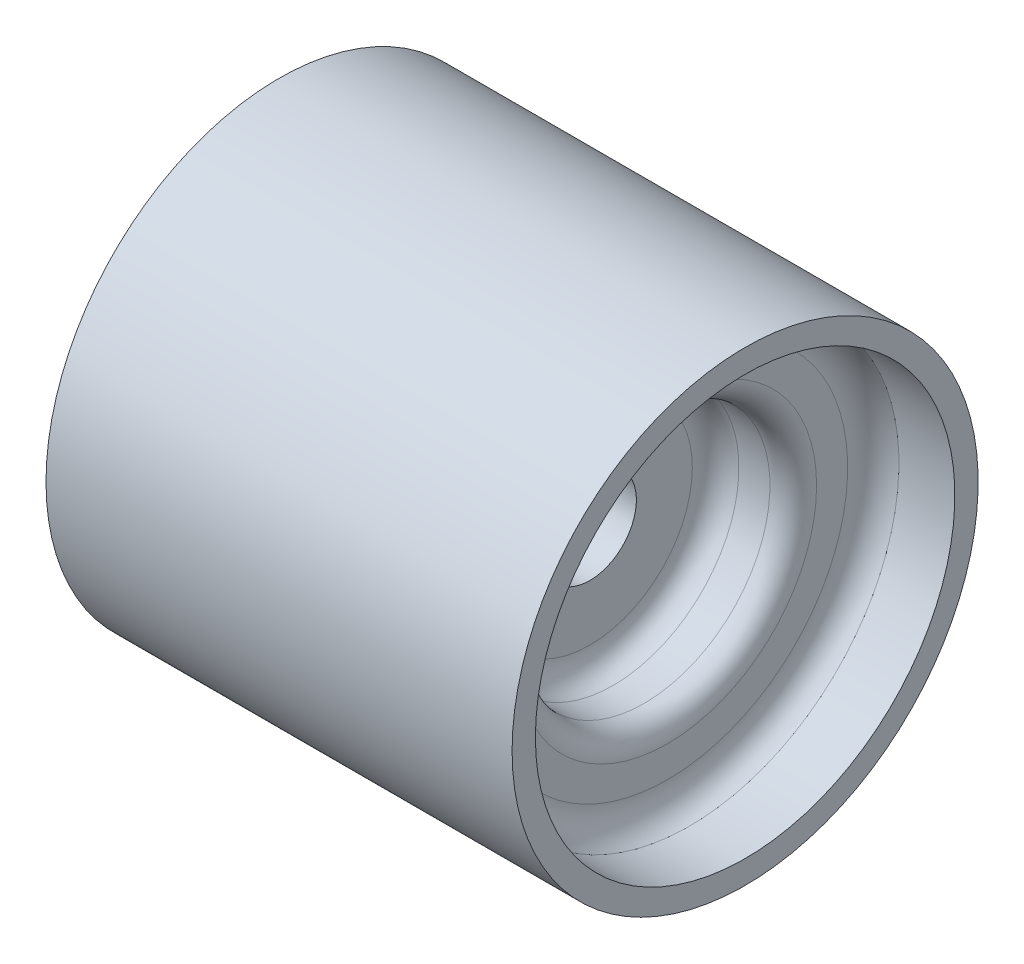
ISO-10303-21;
HEADER;
FILE_DESCRIPTION(('STEP AP214'),'2;1');
FILE_NAME('part.step','',(''),(''),'','','');
FILE_SCHEMA(('AUTOMOTIVE_DESIGN { 1 0 10303 214 1 1 1 1 }'));
ENDSEC;
DATA;
#1=APPLICATION_CONTEXT('core data for automotive mechanical design processes');
#2=APPLICATION_PROTOCOL_DEFINITION('international standard','automotive_design',2000,#1);
#3=PRODUCT_CONTEXT('',#1,'mechanical');
#4=PRODUCT('Part','Part','',(#3));
#5=PRODUCT_RELATED_PRODUCT_CATEGORY('part','',(#4));
#6=PRODUCT_DEFINITION_FORMATION('','',#4);
#7=PRODUCT_DEFINITION_CONTEXT('part definition',#1,'design');
#8=PRODUCT_DEFINITION('design','',#6,#7);
#9=PRODUCT_DEFINITION_SHAPE('','',#8);
#10=(LENGTH_UNIT() NAMED_UNIT(*) SI_UNIT(.MILLI.,.METRE.));
#11=(NAMED_UNIT(*) PLANE_ANGLE_UNIT() SI_UNIT($,.RADIAN.));
#12=(NAMED_UNIT(*) SI_UNIT($,.STERADIAN.) SOLID_ANGLE_UNIT());
#13=UNCERTAINTY_MEASURE_WITH_UNIT(LENGTH_MEASURE(1.E-05),#10,'distance_accuracy_value','');
#14=(GEOMETRIC_REPRESENTATION_CONTEXT(3) GLOBAL_UNCERTAINTY_ASSIGNED_CONTEXT((#13)) GLOBAL_UNIT_ASSIGNED_CONTEXT((#10,
#11,#12)) REPRESENTATION_CONTEXT('',''));
#15=CARTESIAN_POINT('',(0.,0.,0.));
#16=DIRECTION('',(0.,0.,1.));
#17=DIRECTION('',(1.,0.,0.));
#18=AXIS2_PLACEMENT_3D('',#15,#16,#17);
#19=CARTESIAN_POINT('',(0.,12.7,0.));
#20=DIRECTION('',(1.,0.,0.));
#21=DIRECTION('',(0.,0.,-1.));
#22=AXIS2_PLACEMENT_3D('',#19,#20,#21);
#23=PLANE('',#22);
#24=CARTESIAN_POINT('',(0.,0.,0.));
#25=DIRECTION('',(-1.,0.,0.));
#26=DIRECTION('',(0.,0.,1.));
#27=AXIS2_PLACEMENT_3D('',#24,#25,#26);
#28=CIRCLE('',#27,12.7);
#29=CARTESIAN_POINT('',(0.,0.,12.7));
#30=VERTEX_POINT('',#29);
#31=EDGE_CURVE('E10',#30,#30,#28,.T.);
#32=ORIENTED_EDGE('',*,*,#31,.F.);
#33=EDGE_LOOP('',(#32));
#34=FACE_BOUND('',#33,.T.);
#35=CARTESIAN_POINT('',(0.,0.,0.));
#36=DIRECTION('',(-1.,0.,0.));
#37=DIRECTION('',(0.,0.,1.));
#38=AXIS2_PLACEMENT_3D('',#35,#36,#37);
#39=CIRCLE('',#38,27.8553333333342);
#40=CARTESIAN_POINT('',(0.,0.,27.8553333333342));
#41=VERTEX_POINT('',#40);
#42=EDGE_CURVE('E112',#41,#41,#39,.T.);
#43=ORIENTED_EDGE('',*,*,#42,.T.);
#44=EDGE_LOOP('',(#43));
#45=FACE_BOUND('',#44,.T.);
#46=ADVANCED_FACE('F37',(#34,#45),#23,.F.);
#47=CARTESIAN_POINT('',(0.,0.,0.));
#48=DIRECTION('',(-1.,0.,0.));
#49=DIRECTION('',(0.,0.,1.));
#50=AXIS2_PLACEMENT_3D('',#47,#48,#49);
#51=CYLINDRICAL_SURFACE('',#50,12.7);
#52=CARTESIAN_POINT('',(42.3333333333334,0.,0.));
#53=DIRECTION('',(-1.,0.,0.));
#54=DIRECTION('',(0.,0.,1.));
#55=AXIS2_PLACEMENT_3D('',#52,#53,#54);
#56=CIRCLE('',#55,12.7);
#57=CARTESIAN_POINT('',(42.3333333333334,0.,12.7));
#58=VERTEX_POINT('',#57);
#59=EDGE_CURVE('E44',#58,#58,#56,.T.);
#60=ORIENTED_EDGE('',*,*,#59,.F.);
#61=EDGE_LOOP('',(#60));
#62=FACE_BOUND('',#61,.T.);
#63=ORIENTED_EDGE('',*,*,#31,.T.);
#64=EDGE_LOOP('',(#63));
#65=FACE_BOUND('',#64,.T.);
#66=ADVANCED_FACE('F210',(#62,#65),#51,.F.);
#67=CARTESIAN_POINT('',(42.3333333333334,12.7,0.));
#68=DIRECTION('',(-1.,0.,0.));
#69=DIRECTION('',(0.,0.,1.));
#70=AXIS2_PLACEMENT_3D('',#67,#68,#69);
#71=PLANE('',#70);
#72=CARTESIAN_POINT('',(42.3333333333334,0.,0.));
#73=DIRECTION('',(-1.,0.,0.));
#74=DIRECTION('',(0.,0.,1.));
#75=AXIS2_PLACEMENT_3D('',#72,#73,#74);
#76=CIRCLE('',#75,27.94);
#77=CARTESIAN_POINT('',(42.3333333333334,0.,27.94));
#78=VERTEX_POINT('',#77);
#79=EDGE_CURVE('E49',#78,#78,#76,.T.);
#80=ORIENTED_EDGE('',*,*,#79,.F.);
#81=EDGE_LOOP('',(#80));
#82=FACE_BOUND('',#81,.T.);
#83=ORIENTED_EDGE('',*,*,#59,.T.);
#84=EDGE_LOOP('',(#83));
#85=FACE_BOUND('',#84,.T.);
#86=ADVANCED_FACE('F205',(#82,#85),#71,.F.);
#87=CARTESIAN_POINT('',(48.6833333333334,0.,0.));
#88=DIRECTION('',(-1.,0.,0.));
#89=DIRECTION('',(0.,0.,1.));
#90=AXIS2_PLACEMENT_3D('',#87,#88,#89);
#91=TOROIDAL_SURFACE('',#90,27.94,6.35);
#92=CARTESIAN_POINT('',(48.6833333333334,0.,0.));
#93=DIRECTION('',(-1.,0.,0.));
#94=DIRECTION('',(0.,0.,1.));
#95=AXIS2_PLACEMENT_3D('',#92,#93,#94);
#96=CIRCLE('',#95,34.29);
#97=CARTESIAN_POINT('',(48.6833333333334,0.,34.29));
#98=VERTEX_POINT('',#97);
#99=EDGE_CURVE('E54',#98,#98,#96,.T.);
#100=ORIENTED_EDGE('',*,*,#99,.F.);
#101=EDGE_LOOP('',(#100));
#102=FACE_BOUND('',#101,.T.);
#103=ORIENTED_EDGE('',*,*,#79,.T.);
#104=EDGE_LOOP('',(#103));
#105=FACE_BOUND('',#104,.T.);
#106=ADVANCED_FACE('F199',(#102,#105),#91,.F.);
#107=CARTESIAN_POINT('',(0.,0.,0.));
#108=DIRECTION('',(-1.,0.,0.));
#109=DIRECTION('',(0.,0.,1.));
#110=AXIS2_PLACEMENT_3D('',#107,#108,#109);
#111=CYLINDRICAL_SURFACE('',#110,34.29);
#112=CARTESIAN_POINT('',(57.1499999915334,0.,0.));
#113=DIRECTION('',(-1.,0.,0.));
#114=DIRECTION('',(0.,0.,1.));
#115=AXIS2_PLACEMENT_3D('',#112,#113,#114);
#116=CIRCLE('',#115,34.29);
#117=CARTESIAN_POINT('',(57.1499999915334,0.,34.29));
#118=VERTEX_POINT('',#117);
#119=EDGE_CURVE('E60',#118,#118,#116,.T.);
#120=ORIENTED_EDGE('',*,*,#119,.F.);
#121=EDGE_LOOP('',(#120));
#122=FACE_BOUND('',#121,.T.);
#123=ORIENTED_EDGE('',*,*,#99,.T.);
#124=EDGE_LOOP('',(#123));
#125=FACE_BOUND('',#124,.T.);
#126=ADVANCED_FACE('F193',(#122,#125),#111,.F.);
#127=CARTESIAN_POINT('',(57.1499999915334,0.,0.));
#128=DIRECTION('',(-1.,0.,0.));
#129=DIRECTION('',(0.,0.,1.));
#130=AXIS2_PLACEMENT_3D('',#127,#128,#129);
#131=TOROIDAL_SURFACE('',#130,40.64,6.35);
#132=CARTESIAN_POINT('',(63.4999999915334,0.,0.));
#133=DIRECTION('',(-1.,0.,0.));
#134=DIRECTION('',(0.,0.,1.));
#135=AXIS2_PLACEMENT_3D('',#132,#133,#134);
#136=CIRCLE('',#135,40.64);
#137=CARTESIAN_POINT('',(63.4999999915334,0.,40.64));
#138=VERTEX_POINT('',#137);
#139=EDGE_CURVE('E64',#138,#138,#136,.T.);
#140=ORIENTED_EDGE('',*,*,#139,.F.);
#141=EDGE_LOOP('',(#140));
#142=FACE_BOUND('',#141,.T.);
#143=ORIENTED_EDGE('',*,*,#119,.T.);
#144=EDGE_LOOP('',(#143));
#145=FACE_BOUND('',#144,.T.);
#146=ADVANCED_FACE('F187',(#142,#145),#131,.T.);
#147=CARTESIAN_POINT('',(63.4999999915334,49.1066666666658,0.));
#148=DIRECTION('',(-1.,0.,0.));
#149=DIRECTION('',(0.,0.,1.));
#150=AXIS2_PLACEMENT_3D('',#147,#148,#149);
#151=PLANE('',#150);
#152=CARTESIAN_POINT('',(63.4999999915334,0.,0.));
#153=DIRECTION('',(-1.,0.,0.));
#154=DIRECTION('',(0.,0.,1.));
#155=AXIS2_PLACEMENT_3D('',#152,#153,#154);
#156=CIRCLE('',#155,49.1066666666658);
#157=CARTESIAN_POINT('',(63.4999999915334,0.,49.1066666666658));
#158=VERTEX_POINT('',#157);
#159=EDGE_CURVE('E68',#158,#158,#156,.T.);
#160=ORIENTED_EDGE('',*,*,#159,.F.);
#161=EDGE_LOOP('',(#160));
#162=FACE_BOUND('',#161,.T.);
#163=ORIENTED_EDGE('',*,*,#139,.T.);
#164=EDGE_LOOP('',(#163));
#165=FACE_BOUND('',#164,.T.);
#166=ADVANCED_FACE('F181',(#162,#165),#151,.F.);
#167=CARTESIAN_POINT('',(71.0956761550272,0.,0.));
#168=DIRECTION('',(-1.,0.,0.));
#169=DIRECTION('',(0.,0.,1.));
#170=AXIS2_PLACEMENT_3D('',#167,#168,#169);
#171=TOROIDAL_SURFACE('',#170,49.7150280883003,7.62000000000001);
#172=CARTESIAN_POINT('',(69.4266666666667,0.,0.));
#173=DIRECTION('',(-1.,0.,0.));
#174=DIRECTION('',(0.,0.,1.));
#175=AXIS2_PLACEMENT_3D('',#172,#173,#174);
#176=CIRCLE('',#175,57.15);
#177=CARTESIAN_POINT('',(69.4266666666667,0.,57.15));
#178=VERTEX_POINT('',#177);
#179=EDGE_CURVE('E72',#178,#178,#176,.T.);
#180=ORIENTED_EDGE('',*,*,#179,.F.);
#181=EDGE_LOOP('',(#180));
#182=FACE_BOUND('',#181,.T.);
#183=ORIENTED_EDGE('',*,*,#159,.T.);
#184=EDGE_LOOP('',(#183));
#185=FACE_BOUND('',#184,.T.);
#186=ADVANCED_FACE('F175',(#182,#185),#171,.F.);
#187=CARTESIAN_POINT('',(0.,0.,0.));
#188=DIRECTION('',(-1.,0.,0.));
#189=DIRECTION('',(0.,0.,1.));
#190=AXIS2_PLACEMENT_3D('',#187,#188,#189);
#191=CYLINDRICAL_SURFACE('',#190,57.15);
#192=CARTESIAN_POINT('',(84.6666666666668,0.,0.));
#193=DIRECTION('',(-1.,0.,0.));
#194=DIRECTION('',(0.,0.,1.));
#195=AXIS2_PLACEMENT_3D('',#192,#193,#194);
#196=CIRCLE('',#195,57.15);
#197=CARTESIAN_POINT('',(84.6666666666668,0.,57.15));
#198=VERTEX_POINT('',#197);
#199=EDGE_CURVE('E76',#198,#198,#196,.T.);
#200=ORIENTED_EDGE('',*,*,#199,.F.);
#201=EDGE_LOOP('',(#200));
#202=FACE_BOUND('',#201,.T.);
#203=ORIENTED_EDGE('',*,*,#179,.T.);
#204=EDGE_LOOP('',(#203));
#205=FACE_BOUND('',#204,.T.);
#206=ADVANCED_FACE('F169',(#202,#205),#191,.F.);
#207=CARTESIAN_POINT('',(84.6666666666668,57.15,0.));
#208=DIRECTION('',(-1.,0.,0.));
#209=DIRECTION('',(0.,0.,1.));
#210=AXIS2_PLACEMENT_3D('',#207,#208,#209);
#211=PLANE('',#210);
#212=CARTESIAN_POINT('',(84.6666666666668,0.,0.));
#213=DIRECTION('',(-1.,0.,0.));
#214=DIRECTION('',(0.,0.,1.));
#215=AXIS2_PLACEMENT_3D('',#212,#213,#214);
#216=CIRCLE('',#215,63.5);
#217=CARTESIAN_POINT('',(84.6666666666668,0.,63.5));
#218=VERTEX_POINT('',#217);
#219=EDGE_CURVE('E80',#218,#218,#216,.T.);
#220=ORIENTED_EDGE('',*,*,#219,.F.);
#221=EDGE_LOOP('',(#220));
#222=FACE_BOUND('',#221,.T.);
#223=ORIENTED_EDGE('',*,*,#199,.T.);
#224=EDGE_LOOP('',(#223));
#225=FACE_BOUND('',#224,.T.);
#226=ADVANCED_FACE('F163',(#222,#225),#211,.F.);
#227=CARTESIAN_POINT('',(0.,0.,0.));
#228=DIRECTION('',(-1.,0.,0.));
#229=DIRECTION('',(0.,0.,1.));
#230=AXIS2_PLACEMENT_3D('',#227,#228,#229);
#231=CYLINDRICAL_SURFACE('',#230,63.5);
#232=CARTESIAN_POINT('',(-42.3333333333333,0.,0.));
#233=DIRECTION('',(-1.,0.,0.));
#234=DIRECTION('',(0.,0.,1.));
#235=AXIS2_PLACEMENT_3D('',#232,#233,#234);
#236=CIRCLE('',#235,63.5);
#237=CARTESIAN_POINT('',(-42.3333333333333,0.,63.5));
#238=VERTEX_POINT('',#237);
#239=EDGE_CURVE('E84',#238,#238,#236,.T.);
#240=ORIENTED_EDGE('',*,*,#239,.F.);
#241=EDGE_LOOP('',(#240));
#242=FACE_BOUND('',#241,.T.);
#243=ORIENTED_EDGE('',*,*,#219,.T.);
#244=EDGE_LOOP('',(#243));
#245=FACE_BOUND('',#244,.T.);
#246=ADVANCED_FACE('F157',(#242,#245),#231,.T.);
#247=CARTESIAN_POINT('',(-42.3333333333333,57.15,0.));
#248=DIRECTION('',(1.,0.,0.));
#249=DIRECTION('',(0.,0.,-1.));
#250=AXIS2_PLACEMENT_3D('',#247,#248,#249);
#251=PLANE('',#250);
#252=CARTESIAN_POINT('',(-42.3333333333333,0.,0.));
#253=DIRECTION('',(-1.,0.,0.));
#254=DIRECTION('',(0.,0.,1.));
#255=AXIS2_PLACEMENT_3D('',#252,#253,#254);
#256=CIRCLE('',#255,57.15);
#257=CARTESIAN_POINT('',(-42.3333333333333,0.,57.15));
#258=VERTEX_POINT('',#257);
#259=EDGE_CURVE('E88',#258,#258,#256,.T.);
#260=ORIENTED_EDGE('',*,*,#259,.F.);
#261=EDGE_LOOP('',(#260));
#262=FACE_BOUND('',#261,.T.);
#263=ORIENTED_EDGE('',*,*,#239,.T.);
#264=EDGE_LOOP('',(#263));
#265=FACE_BOUND('',#264,.T.);
#266=ADVANCED_FACE('F151',(#262,#265),#251,.F.);
#267=CARTESIAN_POINT('',(0.,0.,0.));
#268=DIRECTION('',(-1.,0.,0.));
#269=DIRECTION('',(0.,0.,1.));
#270=AXIS2_PLACEMENT_3D('',#267,#268,#269);
#271=CYLINDRICAL_SURFACE('',#270,57.15);
#272=CARTESIAN_POINT('',(-27.0933333333333,0.,0.));
#273=DIRECTION('',(-1.,0.,0.));
#274=DIRECTION('',(0.,0.,1.));
#275=AXIS2_PLACEMENT_3D('',#272,#273,#274);
#276=CIRCLE('',#275,57.15);
#277=CARTESIAN_POINT('',(-27.0933333333333,0.,57.15));
#278=VERTEX_POINT('',#277);
#279=EDGE_CURVE('E92',#278,#278,#276,.T.);
#280=ORIENTED_EDGE('',*,*,#279,.F.);
#281=EDGE_LOOP('',(#280));
#282=FACE_BOUND('',#281,.T.);
#283=ORIENTED_EDGE('',*,*,#259,.T.);
#284=EDGE_LOOP('',(#283));
#285=FACE_BOUND('',#284,.T.);
#286=ADVANCED_FACE('F145',(#282,#285),#271,.F.);
#287=CARTESIAN_POINT('',(-28.6721898660213,0.,0.));
#288=DIRECTION('',(-1.,0.,0.));
#289=DIRECTION('',(0.,0.,1.));
#290=AXIS2_PLACEMENT_3D('',#287,#288,#289);
#291=TOROIDAL_SURFACE('',#290,49.6953630504774,7.61999999999997);
#292=CARTESIAN_POINT('',(-21.082,0.,0.));
#293=DIRECTION('',(-1.,0.,0.));
#294=DIRECTION('',(0.,0.,1.));
#295=AXIS2_PLACEMENT_3D('',#292,#293,#294);
#296=CIRCLE('',#295,49.022);
#297=CARTESIAN_POINT('',(-21.082,0.,49.022));
#298=VERTEX_POINT('',#297);
#299=EDGE_CURVE('E96',#298,#298,#296,.T.);
#300=ORIENTED_EDGE('',*,*,#299,.F.);
#301=EDGE_LOOP('',(#300));
#302=FACE_BOUND('',#301,.T.);
#303=ORIENTED_EDGE('',*,*,#279,.T.);
#304=EDGE_LOOP('',(#303));
#305=FACE_BOUND('',#304,.T.);
#306=ADVANCED_FACE('F139',(#302,#305),#291,.F.);
#307=CARTESIAN_POINT('',(-21.082,40.5553333333342,0.));
#308=DIRECTION('',(1.,0.,0.));
#309=DIRECTION('',(0.,0.,-1.));
#310=AXIS2_PLACEMENT_3D('',#307,#308,#309);
#311=PLANE('',#310);
#312=CARTESIAN_POINT('',(-21.082,0.,0.));
#313=DIRECTION('',(-1.,0.,0.));
#314=DIRECTION('',(0.,0.,1.));
#315=AXIS2_PLACEMENT_3D('',#312,#313,#314);
#316=CIRCLE('',#315,40.5553333333342);
#317=CARTESIAN_POINT('',(-21.082,0.,40.5553333333342));
#318=VERTEX_POINT('',#317);
#319=EDGE_CURVE('E100',#318,#318,#316,.T.);
#320=ORIENTED_EDGE('',*,*,#319,.F.);
#321=EDGE_LOOP('',(#320));
#322=FACE_BOUND('',#321,.T.);
#323=ORIENTED_EDGE('',*,*,#299,.T.);
#324=EDGE_LOOP('',(#323));
#325=FACE_BOUND('',#324,.T.);
#326=ADVANCED_FACE('F133',(#322,#325),#311,.F.);
#327=CARTESIAN_POINT('',(-14.478,0.,0.));
#328=DIRECTION('',(-1.,0.,0.));
#329=DIRECTION('',(0.,0.,1.));
#330=AXIS2_PLACEMENT_3D('',#327,#328,#329);
#331=TOROIDAL_SURFACE('',#330,40.8093333333342,6.6088828102789);
#332=CARTESIAN_POINT('',(-14.732,0.,0.));
#333=DIRECTION('',(-1.,0.,0.));
#334=DIRECTION('',(0.,0.,1.));
#335=AXIS2_PLACEMENT_3D('',#332,#333,#334);
#336=CIRCLE('',#335,34.2053333333342);
#337=CARTESIAN_POINT('',(-14.732,0.,34.2053333333342));
#338=VERTEX_POINT('',#337);
#339=EDGE_CURVE('E104',#338,#338,#336,.T.);
#340=ORIENTED_EDGE('',*,*,#339,.F.);
#341=EDGE_LOOP('',(#340));
#342=FACE_BOUND('',#341,.T.);
#343=ORIENTED_EDGE('',*,*,#319,.T.);
#344=EDGE_LOOP('',(#343));
#345=FACE_BOUND('',#344,.T.);
#346=ADVANCED_FACE('F127',(#342,#345),#331,.T.);
#347=CARTESIAN_POINT('',(0.,0.,0.));
#348=DIRECTION('',(-1.,0.,0.));
#349=DIRECTION('',(0.,0.,1.));
#350=AXIS2_PLACEMENT_3D('',#347,#348,#349);
#351=CYLINDRICAL_SURFACE('',#350,34.2053333333342);
#352=CARTESIAN_POINT('',(-6.35,0.,0.));
#353=DIRECTION('',(-1.,0.,0.));
#354=DIRECTION('',(0.,0.,1.));
#355=AXIS2_PLACEMENT_3D('',#352,#353,#354);
#356=CIRCLE('',#355,34.2053333333342);
#357=CARTESIAN_POINT('',(-6.35,0.,34.2053333333342));
#358=VERTEX_POINT('',#357);
#359=EDGE_CURVE('E108',#358,#358,#356,.T.);
#360=ORIENTED_EDGE('',*,*,#359,.F.);
#361=EDGE_LOOP('',(#360));
#362=FACE_BOUND('',#361,.T.);
#363=ORIENTED_EDGE('',*,*,#339,.T.);
#364=EDGE_LOOP('',(#363));
#365=FACE_BOUND('',#364,.T.);
#366=ADVANCED_FACE('F121',(#362,#365),#351,.F.);
#367=CARTESIAN_POINT('',(-6.34999999999999,0.,0.));
#368=DIRECTION('',(-1.,0.,0.));
#369=DIRECTION('',(0.,0.,1.));
#370=AXIS2_PLACEMENT_3D('',#367,#368,#369);
#371=TOROIDAL_SURFACE('',#370,27.8553333333342,6.34999999999999);
#372=ORIENTED_EDGE('',*,*,#42,.F.);
#373=EDGE_LOOP('',(#372));
#374=FACE_BOUND('',#373,.T.);
#375=ORIENTED_EDGE('',*,*,#359,.T.);
#376=EDGE_LOOP('',(#375));
#377=FACE_BOUND('',#376,.T.);
#378=ADVANCED_FACE('F118',(#374,#377),#371,.F.);
#379=CLOSED_SHELL('',(#46,#66,#86,#106,#126,#146,#166,#186,#206,#226,#246,#266,#286,#306,#326,
#346,#366,#378));
#380=MANIFOLD_SOLID_BREP('B2',#379);
#381=ADVANCED_BREP_SHAPE_REPRESENTATION('',(#18,#380),#14);
#382=SHAPE_DEFINITION_REPRESENTATION(#9,#381);
ENDSEC;
END-ISO-10303-21;
